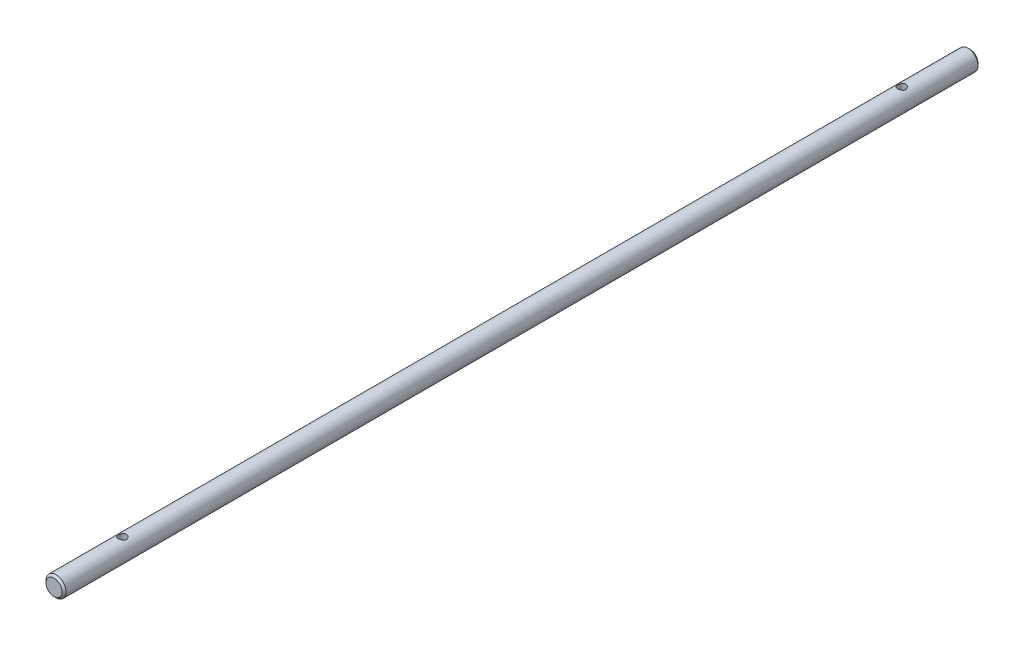
ISO-10303-21;
HEADER;
FILE_DESCRIPTION(('STEP AP214'),'2;1');
FILE_NAME('part.step','',(''),(''),'','','');
FILE_SCHEMA(('AUTOMOTIVE_DESIGN { 1 0 10303 214 1 1 1 1 }'));
ENDSEC;
DATA;
#1=APPLICATION_CONTEXT('core data for automotive mechanical design processes');
#2=APPLICATION_PROTOCOL_DEFINITION('international standard','automotive_design',2000,#1);
#3=PRODUCT_CONTEXT('',#1,'mechanical');
#4=PRODUCT('Part','Part','',(#3));
#5=PRODUCT_RELATED_PRODUCT_CATEGORY('part','',(#4));
#6=PRODUCT_DEFINITION_FORMATION('','',#4);
#7=PRODUCT_DEFINITION_CONTEXT('part definition',#1,'design');
#8=PRODUCT_DEFINITION('design','',#6,#7);
#9=PRODUCT_DEFINITION_SHAPE('','',#8);
#10=(LENGTH_UNIT() NAMED_UNIT(*) SI_UNIT(.MILLI.,.METRE.));
#11=(NAMED_UNIT(*) PLANE_ANGLE_UNIT() SI_UNIT($,.RADIAN.));
#12=(NAMED_UNIT(*) SI_UNIT($,.STERADIAN.) SOLID_ANGLE_UNIT());
#13=UNCERTAINTY_MEASURE_WITH_UNIT(LENGTH_MEASURE(1.E-05),#10,'distance_accuracy_value','');
#14=(GEOMETRIC_REPRESENTATION_CONTEXT(3) GLOBAL_UNCERTAINTY_ASSIGNED_CONTEXT((#13)) GLOBAL_UNIT_ASSIGNED_CONTEXT((#10,
#11,#12)) REPRESENTATION_CONTEXT('',''));
#15=CARTESIAN_POINT('',(0.,0.,0.));
#16=DIRECTION('',(0.,0.,1.));
#17=DIRECTION('',(1.,0.,0.));
#18=AXIS2_PLACEMENT_3D('',#15,#16,#17);
#19=CARTESIAN_POINT('',(0.,0.,228.));
#20=DIRECTION('',(0.,0.,-1.));
#21=DIRECTION('',(-1.,0.,0.));
#22=AXIS2_PLACEMENT_3D('',#19,#20,#21);
#23=CYLINDRICAL_SURFACE('',#22,2.5);
#24=CARTESIAN_POINT('',(0.,-2.49999999999999,212.));
#25=CARTESIAN_POINT('',(0.0537465027214453,-2.4999963561354,211.999995074088));
#26=CARTESIAN_POINT('',(0.107586282045337,-2.49824647153466,211.995641123956));
#27=CARTESIAN_POINT('',(0.213748240208949,-2.49141726550321,211.978376148239));
#28=CARTESIAN_POINT('',(0.266065888780626,-2.48632889349439,211.965441860457));
#29=CARTESIAN_POINT('',(0.367476961363706,-2.47337104606559,211.931561960971));
#30=CARTESIAN_POINT('',(0.416580330808486,-2.46551068182036,211.910642576892));
#31=CARTESIAN_POINT('',(0.51053598516419,-2.44778305398039,211.861490413337));
#32=CARTESIAN_POINT('',(0.5553897383755,-2.43791648729028,211.833260172541));
#33=CARTESIAN_POINT('',(0.641750503785199,-2.41665443085209,211.76888225072));
#34=CARTESIAN_POINT('',(0.68303113627511,-2.40521148464595,211.73244667188));
#35=CARTESIAN_POINT('',(0.759087502392361,-2.38230288453097,211.653299998262));
#36=CARTESIAN_POINT('',(0.79386005356676,-2.37083722226896,211.610585851394));
#37=CARTESIAN_POINT('',(0.857437283646434,-2.34861395898568,211.517785964879));
#38=CARTESIAN_POINT('',(0.885907490597738,-2.33791057982476,211.467456756988));
#39=CARTESIAN_POINT('',(0.933877359518579,-2.31916823593396,211.36223180079));
#40=CARTESIAN_POINT('',(0.953381282142921,-2.31112800622088,211.307338236076));
#41=CARTESIAN_POINT('',(0.981949411697937,-2.29913178830409,211.197143833204));
#42=CARTESIAN_POINT('',(0.991446982902829,-2.29500710177802,211.141974382212));
#43=CARTESIAN_POINT('',(1.00108648082002,-2.29082002024572,211.030682500846));
#44=CARTESIAN_POINT('',(1.00123300815661,-2.29075562761384,210.974560552688));
#45=CARTESIAN_POINT('',(0.992494683752272,-2.29455250139997,210.867121664271));
#46=CARTESIAN_POINT('',(0.984237657152572,-2.29814087519225,210.815742142796));
#47=CARTESIAN_POINT('',(0.959973440148913,-2.30838093803918,210.715170221997));
#48=CARTESIAN_POINT('',(0.943964897402315,-2.31503316160836,210.665978205945));
#49=CARTESIAN_POINT('',(0.904347366275531,-2.33079742544265,210.569991081902));
#50=CARTESIAN_POINT('',(0.880589931157651,-2.33995689640394,210.523265380473));
#51=CARTESIAN_POINT('',(0.826253230366097,-2.35969058194945,210.434292091819));
#52=CARTESIAN_POINT('',(0.795671402550412,-2.37026532728425,210.392046195299));
#53=CARTESIAN_POINT('',(0.725775299727214,-2.39263368371135,210.309795135599));
#54=CARTESIAN_POINT('',(0.685968731485321,-2.40445832488076,210.270215635277));
#55=CARTESIAN_POINT('',(0.600157213715104,-2.42729912479141,210.198157760999));
#56=CARTESIAN_POINT('',(0.554151032667222,-2.43831512222662,210.165680801295));
#57=CARTESIAN_POINT('',(0.456038826302923,-2.45857340632274,210.108191276292));
#58=CARTESIAN_POINT('',(0.403830245673238,-2.46777635047707,210.083338859401));
#59=CARTESIAN_POINT('',(0.295511882741437,-2.4830741416438,210.042916069461));
#60=CARTESIAN_POINT('',(0.239404098424832,-2.48917056731191,210.027340981221));
#61=CARTESIAN_POINT('',(0.128447943803903,-2.49728069753455,210.00677585229));
#62=CARTESIAN_POINT('',(0.0737216469927591,-2.49951472916757,210.001213772873));
#63=CARTESIAN_POINT('',(-0.0359226549039192,-2.50034239255315,209.999143449736));
#64=CARTESIAN_POINT('',(-0.0908406066119739,-2.49893696791146,210.002632859226));
#65=CARTESIAN_POINT('',(-0.196716369561005,-2.49278783531876,210.018145876276));
#66=CARTESIAN_POINT('',(-0.247741245887747,-2.48819695672762,210.029778990176));
#67=CARTESIAN_POINT('',(-0.347067714030399,-2.4762972070275,210.060717854155));
#68=CARTESIAN_POINT('',(-0.395368955112432,-2.46898798678265,210.080024589834));
#69=CARTESIAN_POINT('',(-0.48953939290836,-2.45208297385406,210.12639246984));
#70=CARTESIAN_POINT('',(-0.535289011377711,-2.44242407989902,210.153672736022));
#71=CARTESIAN_POINT('',(-0.621721795623284,-2.42186682372762,210.214970161953));
#72=CARTESIAN_POINT('',(-0.662402920380567,-2.41096796555135,210.248990021461));
#73=CARTESIAN_POINT('',(-0.74036152151441,-2.38822558819056,210.325435006475));
#74=CARTESIAN_POINT('',(-0.777236966903033,-2.37636720712526,210.368266770753));
#75=CARTESIAN_POINT('',(-0.843375598706858,-2.35370836458566,210.459720041505));
#76=CARTESIAN_POINT('',(-0.872637530668759,-2.34290807763255,210.50834250017));
#77=CARTESIAN_POINT('',(-0.922903750965823,-2.32357149953854,210.610730847297));
#78=CARTESIAN_POINT('',(-0.943825297267238,-2.31505815442393,210.664541999606));
#79=CARTESIAN_POINT('',(-0.976148109852659,-2.30161836738965,210.775366825858));
#80=CARTESIAN_POINT('',(-0.987556402634662,-2.29668927847999,210.832378102906));
#81=CARTESIAN_POINT('',(-0.999857808639203,-2.29135879649963,210.943563950887));
#82=CARTESIAN_POINT('',(-1.00144854115144,-2.29065710504086,210.997647419797));
#83=CARTESIAN_POINT('',(-0.995901579638762,-2.29307418016549,211.105272428857));
#84=CARTESIAN_POINT('',(-0.988764993956891,-2.29619246162397,211.158814036951));
#85=CARTESIAN_POINT('',(-0.966535683076824,-2.3056332453951,211.261666094928));
#86=CARTESIAN_POINT('',(-0.951768746785487,-2.31182415913725,211.311060137217));
#87=CARTESIAN_POINT('',(-0.915002724245496,-2.32662000616349,211.406689314807));
#88=CARTESIAN_POINT('',(-0.893001640696892,-2.33522560603004,211.45292357345));
#89=CARTESIAN_POINT('',(-0.840936381379846,-2.35449304802246,211.543804809635));
#90=CARTESIAN_POINT('',(-0.810482667579725,-2.36524441156622,211.588209335065));
#91=CARTESIAN_POINT('',(-0.742946059635728,-2.38731902186119,211.671496658602));
#92=CARTESIAN_POINT('',(-0.705861167409043,-2.39864244024204,211.710377786064));
#93=CARTESIAN_POINT('',(-0.623252753136219,-2.42146783543697,211.784101426632));
#94=CARTESIAN_POINT('',(-0.577338000573056,-2.43293378981093,211.818518653449));
#95=CARTESIAN_POINT('',(-0.479950160142878,-2.45400203356859,211.879168521311));
#96=CARTESIAN_POINT('',(-0.428474502273609,-2.46360345546453,211.905397356076));
#97=CARTESIAN_POINT('',(-0.322369031247594,-2.47969857407931,211.948311107595));
#98=CARTESIAN_POINT('',(-0.26781580910984,-2.48624681527514,211.96516466178));
#99=CARTESIAN_POINT('',(-0.156438273140599,-2.49572153104683,211.989319560477));
#100=CARTESIAN_POINT('',(-0.0996217629294417,-2.4986594974782,211.996651218372));
#101=CARTESIAN_POINT('',(-0.0284561489454537,-2.49987949752068,211.999697690489));
#102=CARTESIAN_POINT('',(-0.0142313443703737,-2.50000096484587,212.000001304315));
#103=CARTESIAN_POINT('',(0.,-2.49999999999999,212.));
#104=B_SPLINE_CURVE_WITH_KNOTS('',3,(#24,#25,#26,#27,#28,#29,#30,#31,#32,#33,#34,#35,#36,#37,
#38,#39,#40,#41,#42,#43,#44,#45,#46,#47,#48,#49,#50,#51,#52,#53,#54,#55,#56,#57,#58,#59,#60,#61,
#62,#63,#64,#65,#66,#67,#68,#69,#70,#71,#72,#73,#74,#75,#76,#77,#78,#79,#80,#81,#82,#83,#84,#85,
#86,#87,#88,#89,#90,#91,#92,#93,#94,#95,#96,#97,#98,#99,#100,#101,#102,#103),.UNSPECIFIED.,.T.,
.F.,(4,2,2,2,2,2,2,2,2,2,2,2,2,2,2,2,2,2,2,2,2,2,2,2,2,2,2,2,2,2,2,2,2,2,2,2,2,2,2,4),(0.,
0.161201493946535,0.32284181800397,0.4839557287358,0.645013767839926,0.81298690850198,
0.98104197467205,1.1565762940961,1.33202711559136,1.49952052654417,1.66693153170245,
1.82269164200687,1.97847893628024,2.13744563149409,2.29647210969093,2.46779174593278,
2.63914546419865,2.81388456581404,2.98853478056896,3.15284592264005,3.31711446785043,
3.47400227782184,3.630910244969,3.79261756699132,3.95438979749485,4.12684237312206,
4.29932334521874,4.47347522570418,4.64749836322969,4.80899836696376,4.97047786281523,
5.12557159274389,5.28070817902585,5.44472734028352,5.60879600674198,5.78350211766922,
5.95828931820269,6.12982150506661,6.30080626202174,6.34349022948399),.UNSPECIFIED.);
#105=CARTESIAN_POINT('',(0.,-2.49999999999999,212.));
#106=VERTEX_POINT('',#105);
#107=EDGE_CURVE('E33',#106,#106,#104,.T.);
#108=ORIENTED_EDGE('',*,*,#107,.T.);
#109=EDGE_LOOP('',(#108));
#110=FACE_BOUND('',#109,.T.);
#111=CARTESIAN_POINT('',(0.,2.50000000000001,212.));
#112=CARTESIAN_POINT('',(-0.053746502721444,2.49999635613545,211.999995074088));
#113=CARTESIAN_POINT('',(-0.107586282045334,2.49824647153467,211.995641123956));
#114=CARTESIAN_POINT('',(-0.213748240208946,2.4914172655032,211.978376148239));
#115=CARTESIAN_POINT('',(-0.266065888780624,2.48632889349438,211.965441860457));
#116=CARTESIAN_POINT('',(-0.367476961363706,2.47337104606559,211.931561960971));
#117=CARTESIAN_POINT('',(-0.416580330808487,2.46551068182036,211.910642576892));
#118=CARTESIAN_POINT('',(-0.510535985164191,2.44778305398039,211.861490413337));
#119=CARTESIAN_POINT('',(-0.5553897383755,2.43791648729028,211.833260172541));
#120=CARTESIAN_POINT('',(-0.641750503785198,2.41665443085209,211.76888225072));
#121=CARTESIAN_POINT('',(-0.68303113627511,2.40521148464595,211.73244667188));
#122=CARTESIAN_POINT('',(-0.75908750239236,2.38230288453097,211.653299998262));
#123=CARTESIAN_POINT('',(-0.79386005356676,2.37083722226896,211.610585851394));
#124=CARTESIAN_POINT('',(-0.857437283646434,2.34861395898568,211.517785964879));
#125=CARTESIAN_POINT('',(-0.885907490597738,2.33791057982476,211.467456756988));
#126=CARTESIAN_POINT('',(-0.933877359518579,2.31916823593396,211.36223180079));
#127=CARTESIAN_POINT('',(-0.953381282142921,2.31112800622088,211.307338236076));
#128=CARTESIAN_POINT('',(-0.981949411697935,2.29913178830409,211.197143833204));
#129=CARTESIAN_POINT('',(-0.991446982902826,2.29500710177802,211.141974382212));
#130=CARTESIAN_POINT('',(-1.00108648082002,2.29082002024572,211.030682500846));
#131=CARTESIAN_POINT('',(-1.00123300815661,2.29075562761384,210.974560552688));
#132=CARTESIAN_POINT('',(-0.992494683752273,2.29455250139997,210.867121664271));
#133=CARTESIAN_POINT('',(-0.984237657152572,2.29814087519225,210.815742142796));
#134=CARTESIAN_POINT('',(-0.959973440148912,2.30838093803918,210.715170221997));
#135=CARTESIAN_POINT('',(-0.943964897402314,2.31503316160837,210.665978205945));
#136=CARTESIAN_POINT('',(-0.904347366275538,2.33079742544265,210.569991081902));
#137=CARTESIAN_POINT('',(-0.880589931157669,2.33995689640393,210.523265380473));
#138=CARTESIAN_POINT('',(-0.826253230366125,2.35969058194944,210.434292091819));
#139=CARTESIAN_POINT('',(-0.795671402550437,2.37026532728424,210.392046195299));
#140=CARTESIAN_POINT('',(-0.725775299727235,2.39263368371135,210.309795135599));
#141=CARTESIAN_POINT('',(-0.685968731485341,2.40445832488075,210.270215635277));
#142=CARTESIAN_POINT('',(-0.600157213715119,2.4272991247914,210.198157760999));
#143=CARTESIAN_POINT('',(-0.554151032667232,2.43831512222662,210.165680801295));
#144=CARTESIAN_POINT('',(-0.456038826302925,2.45857340632274,210.108191276292));
#145=CARTESIAN_POINT('',(-0.40383024567324,2.46777635047707,210.083338859401));
#146=CARTESIAN_POINT('',(-0.295511882741437,2.48307414164379,210.042916069461));
#147=CARTESIAN_POINT('',(-0.239404098424832,2.48917056731191,210.027340981221));
#148=CARTESIAN_POINT('',(-0.128447943803903,2.49728069753455,210.00677585229));
#149=CARTESIAN_POINT('',(-0.0737216469927593,2.49951472916757,210.001213772873));
#150=CARTESIAN_POINT('',(0.0359226549039191,2.50034239255315,209.999143449736));
#151=CARTESIAN_POINT('',(0.0908406066119736,2.49893696791146,210.002632859226));
#152=CARTESIAN_POINT('',(0.196716369561005,2.49278783531876,210.018145876276));
#153=CARTESIAN_POINT('',(0.247741245887747,2.48819695672762,210.029778990176));
#154=CARTESIAN_POINT('',(0.347067714030398,2.4762972070275,210.060717854155));
#155=CARTESIAN_POINT('',(0.395368955112431,2.46898798678265,210.080024589834));
#156=CARTESIAN_POINT('',(0.48953939290836,2.45208297385406,210.12639246984));
#157=CARTESIAN_POINT('',(0.535289011377711,2.44242407989902,210.153672736022));
#158=CARTESIAN_POINT('',(0.621721795623284,2.42186682372762,210.214970161953));
#159=CARTESIAN_POINT('',(0.662402920380566,2.41096796555135,210.248990021461));
#160=CARTESIAN_POINT('',(0.74036152151441,2.38822558819056,210.325435006475));
#161=CARTESIAN_POINT('',(0.777236966903033,2.37636720712526,210.368266770753));
#162=CARTESIAN_POINT('',(0.843375598706858,2.35370836458566,210.459720041505));
#163=CARTESIAN_POINT('',(0.872637530668759,2.34290807763255,210.50834250017));
#164=CARTESIAN_POINT('',(0.922903750965823,2.32357149953854,210.610730847297));
#165=CARTESIAN_POINT('',(0.943825297267238,2.31505815442393,210.664541999606));
#166=CARTESIAN_POINT('',(0.976148109852659,2.30161836738965,210.775366825858));
#167=CARTESIAN_POINT('',(0.987556402634662,2.29668927847999,210.832378102906));
#168=CARTESIAN_POINT('',(0.999857808639203,2.29135879649963,210.943563950887));
#169=CARTESIAN_POINT('',(1.00144854115144,2.29065710504086,210.997647419797));
#170=CARTESIAN_POINT('',(0.995901579638762,2.29307418016549,211.105272428857));
#171=CARTESIAN_POINT('',(0.988764993956891,2.29619246162397,211.158814036951));
#172=CARTESIAN_POINT('',(0.966535683076824,2.3056332453951,211.261666094928));
#173=CARTESIAN_POINT('',(0.951768746785486,2.31182415913725,211.311060137217));
#174=CARTESIAN_POINT('',(0.915002724245496,2.32662000616349,211.406689314807));
#175=CARTESIAN_POINT('',(0.893001640696893,2.33522560603004,211.45292357345));
#176=CARTESIAN_POINT('',(0.84093638137985,2.35449304802246,211.543804809635));
#177=CARTESIAN_POINT('',(0.810482667579731,2.36524441156621,211.588209335065));
#178=CARTESIAN_POINT('',(0.742946059635736,2.38731902186119,211.671496658602));
#179=CARTESIAN_POINT('',(0.705861167409049,2.39864244024203,211.710377786064));
#180=CARTESIAN_POINT('',(0.62325275313622,2.42146783543697,211.784101426632));
#181=CARTESIAN_POINT('',(0.577338000573056,2.43293378981093,211.818518653449));
#182=CARTESIAN_POINT('',(0.479950160142876,2.45400203356859,211.879168521311));
#183=CARTESIAN_POINT('',(0.428474502273608,2.46360345546453,211.905397356076));
#184=CARTESIAN_POINT('',(0.322369031247594,2.47969857407931,211.948311107595));
#185=CARTESIAN_POINT('',(0.267815809109841,2.48624681527514,211.96516466178));
#186=CARTESIAN_POINT('',(0.1564382731406,2.49572153104682,211.989319560477));
#187=CARTESIAN_POINT('',(0.0996217629294421,2.49865949747817,211.996651218372));
#188=CARTESIAN_POINT('',(0.0284561489454537,2.49987949752069,211.999697690489));
#189=CARTESIAN_POINT('',(0.0142313443703736,2.50000096484589,212.000001304315));
#190=CARTESIAN_POINT('',(0.,2.50000000000001,212.));
#191=B_SPLINE_CURVE_WITH_KNOTS('',3,(#111,#112,#113,#114,#115,#116,#117,#118,#119,#120,#121,
#122,#123,#124,#125,#126,#127,#128,#129,#130,#131,#132,#133,#134,#135,#136,#137,#138,#139,#140,
#141,#142,#143,#144,#145,#146,#147,#148,#149,#150,#151,#152,#153,#154,#155,#156,#157,#158,#159,
#160,#161,#162,#163,#164,#165,#166,#167,#168,#169,#170,#171,#172,#173,#174,#175,#176,#177,#178,
#179,#180,#181,#182,#183,#184,#185,#186,#187,#188,#189,#190),.UNSPECIFIED.,.T.,.F.,(4,2,2,2,2,2,
2,2,2,2,2,2,2,2,2,2,2,2,2,2,2,2,2,2,2,2,2,2,2,2,2,2,2,2,2,2,2,2,2,4),(0.,0.161201493946532,
0.32284181800397,0.483955728735801,0.645013767839926,0.812986908501981,0.98104197467205,
1.1565762940961,1.33202711559136,1.49952052654414,1.66693153170245,1.82269164200687,
1.97847893628024,2.13744563149405,2.29647210969089,2.46779174593274,2.63914546419865,
2.81388456581404,2.98853478056896,3.15284592264005,3.31711446785043,3.47400227782185,
3.630910244969,3.79261756699132,3.95438979749485,4.12684237312206,4.29932334521875,
4.47347522570418,4.6474983632297,4.80899836696376,4.97047786281524,5.12557159274389,
5.28070817902585,5.4447273402835,5.60879600674198,5.78350211766922,5.95828931820269,
6.12982150506661,6.30080626202174,6.34349022948399),.UNSPECIFIED.);
#192=CARTESIAN_POINT('',(0.,2.50000000000001,212.));
#193=VERTEX_POINT('',#192);
#194=EDGE_CURVE('E91',#193,#193,#191,.T.);
#195=ORIENTED_EDGE('',*,*,#194,.T.);
#196=EDGE_LOOP('',(#195));
#197=FACE_BOUND('',#196,.T.);
#198=CARTESIAN_POINT('',(0.,-2.49999999999999,18.));
#199=CARTESIAN_POINT('',(0.0537465027214464,-2.4999963561354,17.9999950740881));
#200=CARTESIAN_POINT('',(0.107586282045338,-2.49824647153466,17.9956411239558));
#201=CARTESIAN_POINT('',(0.213748240208949,-2.49141726550322,17.9783761482394));
#202=CARTESIAN_POINT('',(0.266065888780624,-2.48632889349439,17.9654418604569));
#203=CARTESIAN_POINT('',(0.3674769613637,-2.47337104606559,17.9315619609706));
#204=CARTESIAN_POINT('',(0.416580330808477,-2.46551068182036,17.9106425768916));
#205=CARTESIAN_POINT('',(0.510535985164182,-2.44778305398039,17.8614904133367));
#206=CARTESIAN_POINT('',(0.555389738375494,-2.43791648729028,17.8332601725405));
#207=CARTESIAN_POINT('',(0.641750503785196,-2.41665443085209,17.7688822507195));
#208=CARTESIAN_POINT('',(0.683031136275106,-2.40521148464595,17.7324466718799));
#209=CARTESIAN_POINT('',(0.759087502392361,-2.38230288453097,17.6532999982616));
#210=CARTESIAN_POINT('',(0.793860053566766,-2.37083722226896,17.6105858513941));
#211=CARTESIAN_POINT('',(0.85743728364644,-2.34861395898568,17.5177859648789));
#212=CARTESIAN_POINT('',(0.885907490597737,-2.33791057982476,17.4674567569884));
#213=CARTESIAN_POINT('',(0.933877359518575,-2.31916823593396,17.36223180079));
#214=CARTESIAN_POINT('',(0.953381282142919,-2.31112800622088,17.3073382360758));
#215=CARTESIAN_POINT('',(0.981949411697936,-2.29913178830409,17.1971438332039));
#216=CARTESIAN_POINT('',(0.991446982902826,-2.29500710177802,17.1419743822119));
#217=CARTESIAN_POINT('',(1.00108648082002,-2.29082002024572,17.0306825008464));
#218=CARTESIAN_POINT('',(1.00123300815661,-2.29075562761384,16.9745605526875));
#219=CARTESIAN_POINT('',(0.992494683752274,-2.29455250139997,16.867121664271));
#220=CARTESIAN_POINT('',(0.98423765715257,-2.29814087519225,16.8157421427955));
#221=CARTESIAN_POINT('',(0.959973440148911,-2.30838093803918,16.7151702219966));
#222=CARTESIAN_POINT('',(0.943964897402316,-2.31503316160836,16.6659782059448));
#223=CARTESIAN_POINT('',(0.904347366275537,-2.33079742544265,16.569991081902));
#224=CARTESIAN_POINT('',(0.880589931157658,-2.33995689640394,16.5232653804727));
#225=CARTESIAN_POINT('',(0.826253230366106,-2.35969058194945,16.4342920918192));
#226=CARTESIAN_POINT('',(0.79567140255042,-2.37026532728424,16.3920461952986));
#227=CARTESIAN_POINT('',(0.725775299727216,-2.39263368371135,16.309795135599));
#228=CARTESIAN_POINT('',(0.685968731485317,-2.40445832488076,16.270215635277));
#229=CARTESIAN_POINT('',(0.600157213715097,-2.42729912479141,16.198157760999));
#230=CARTESIAN_POINT('',(0.554151032667218,-2.43831512222662,16.1656808012949));
#231=CARTESIAN_POINT('',(0.456038826302924,-2.45857340632274,16.1081912762921));
#232=CARTESIAN_POINT('',(0.403830245673242,-2.46777635047707,16.0833388594015));
#233=CARTESIAN_POINT('',(0.295511882741445,-2.48307414164379,16.042916069461));
#234=CARTESIAN_POINT('',(0.239404098424841,-2.48917056731191,16.0273409812213));
#235=CARTESIAN_POINT('',(0.128447943803914,-2.49728069753455,16.0067758522902));
#236=CARTESIAN_POINT('',(0.0737216469927709,-2.49951472916757,16.0012137728732));
#237=CARTESIAN_POINT('',(-0.0359226549039057,-2.50034239255315,15.9991434497357));
#238=CARTESIAN_POINT('',(-0.0908406066119594,-2.49893696791146,16.0026328592262));
#239=CARTESIAN_POINT('',(-0.196716369560992,-2.49278783531876,16.018145876276));
#240=CARTESIAN_POINT('',(-0.247741245887736,-2.48819695672762,16.0297789901755));
#241=CARTESIAN_POINT('',(-0.34706771403039,-2.4762972070275,16.0607178541549));
#242=CARTESIAN_POINT('',(-0.395368955112423,-2.46898798678265,16.0800245898343));
#243=CARTESIAN_POINT('',(-0.489539392908352,-2.45208297385406,16.12639246984));
#244=CARTESIAN_POINT('',(-0.535289011377704,-2.44242407989902,16.1536727360216));
#245=CARTESIAN_POINT('',(-0.62172179562328,-2.42186682372762,16.2149701619528));
#246=CARTESIAN_POINT('',(-0.662402920380565,-2.41096796555135,16.2489900214613));
#247=CARTESIAN_POINT('',(-0.740361521514412,-2.38822558819056,16.3254350064748));
#248=CARTESIAN_POINT('',(-0.777236966903036,-2.37636720712526,16.3682667707531));
#249=CARTESIAN_POINT('',(-0.843375598706858,-2.35370836458566,16.4597200415047));
#250=CARTESIAN_POINT('',(-0.872637530668756,-2.34290807763255,16.50834250017));
#251=CARTESIAN_POINT('',(-0.922903750965815,-2.32357149953854,16.6107308472971));
#252=CARTESIAN_POINT('',(-0.943825297267228,-2.31505815442394,16.6645419996062));
#253=CARTESIAN_POINT('',(-0.976148109852653,-2.30161836738966,16.7753668258576));
#254=CARTESIAN_POINT('',(-0.987556402634659,-2.29668927847999,16.8323781029062));
#255=CARTESIAN_POINT('',(-0.999857808639203,-2.29135879649963,16.9435639508873));
#256=CARTESIAN_POINT('',(-1.00144854115144,-2.29065710504086,16.9976474197967));
#257=CARTESIAN_POINT('',(-0.995901579638764,-2.29307418016549,17.1052724288566));
#258=CARTESIAN_POINT('',(-0.988764993956893,-2.29619246162397,17.1588140369513));
#259=CARTESIAN_POINT('',(-0.966535683076827,-2.3056332453951,17.2616660949275));
#260=CARTESIAN_POINT('',(-0.951768746785492,-2.31182415913725,17.3110601372165));
#261=CARTESIAN_POINT('',(-0.91500272424551,-2.32662000616348,17.4066893148067));
#262=CARTESIAN_POINT('',(-0.89300164069691,-2.33522560603003,17.4529235734499));
#263=CARTESIAN_POINT('',(-0.840936381379868,-2.35449304802246,17.5438048096354));
#264=CARTESIAN_POINT('',(-0.810482667579748,-2.36524441156621,17.5882093350652));
#265=CARTESIAN_POINT('',(-0.742946059635751,-2.38731902186119,17.6714966586019));
#266=CARTESIAN_POINT('',(-0.705861167409064,-2.39864244024203,17.7103777860642));
#267=CARTESIAN_POINT('',(-0.623252753136233,-2.42146783543697,17.7841014266318));
#268=CARTESIAN_POINT('',(-0.57733800057307,-2.43293378981093,17.818518653449));
#269=CARTESIAN_POINT('',(-0.479950160142889,-2.45400203356858,17.8791685213108));
#270=CARTESIAN_POINT('',(-0.428474502273618,-2.46360345546453,17.9053973560763));
#271=CARTESIAN_POINT('',(-0.3223690312476,-2.4796985740793,17.9483111075951));
#272=CARTESIAN_POINT('',(-0.267815809109845,-2.48624681527513,17.9651646617802));
#273=CARTESIAN_POINT('',(-0.156438273140607,-2.49572153104683,17.9893195604771));
#274=CARTESIAN_POINT('',(-0.0996217629294543,-2.4986594974782,17.996651218372));
#275=CARTESIAN_POINT('',(-0.0284561489454639,-2.49987949752068,17.9996976904891));
#276=CARTESIAN_POINT('',(-0.0142313443703787,-2.50000096484587,18.0000013043146));
#277=CARTESIAN_POINT('',(0.,-2.49999999999999,18.));
#278=B_SPLINE_CURVE_WITH_KNOTS('',3,(#198,#199,#200,#201,#202,#203,#204,#205,#206,#207,#208,
#209,#210,#211,#212,#213,#214,#215,#216,#217,#218,#219,#220,#221,#222,#223,#224,#225,#226,#227,
#228,#229,#230,#231,#232,#233,#234,#235,#236,#237,#238,#239,#240,#241,#242,#243,#244,#245,#246,
#247,#248,#249,#250,#251,#252,#253,#254,#255,#256,#257,#258,#259,#260,#261,#262,#263,#264,#265,
#266,#267,#268,#269,#270,#271,#272,#273,#274,#275,#276,#277),.UNSPECIFIED.,.T.,.F.,(4,2,2,2,2,2,
2,2,2,2,2,2,2,2,2,2,2,2,2,2,2,2,2,2,2,2,2,2,2,2,2,2,2,2,2,2,2,2,2,4),(0.,0.161201493946537,
0.322841818003966,0.483955728735787,0.645013767839919,0.812986908501986,0.981041974672056,
1.15657629409608,1.33202711559134,1.49952052654415,1.66693153170244,1.82269164200687,
1.97847893628024,2.13744563149409,2.29647210969092,2.46779174593279,2.63914546419867,
2.81388456581403,2.98853478056895,3.15284592264004,3.31711446785041,3.47400227782183,
3.63091024496899,3.79261756699132,3.95438979749485,4.12684237312208,4.29932334521875,
4.47347522570414,4.64749836322967,4.80899836696375,4.97047786281523,5.12557159274385,
5.28070817902581,5.44472734028347,5.60879600674197,5.78350211766919,5.95828931820268,
6.12982150506661,6.30080626202172,6.34349022948399),.UNSPECIFIED.);
#279=CARTESIAN_POINT('',(0.,-2.49999999999999,18.));
#280=VERTEX_POINT('',#279);
#281=EDGE_CURVE('E55',#280,#280,#278,.T.);
#282=ORIENTED_EDGE('',*,*,#281,.T.);
#283=EDGE_LOOP('',(#282));
#284=FACE_BOUND('',#283,.T.);
#285=CARTESIAN_POINT('',(0.,2.50000000000001,18.));
#286=CARTESIAN_POINT('',(-0.0537465027214451,2.49999635613545,17.9999950740881));
#287=CARTESIAN_POINT('',(-0.107586282045336,2.49824647153467,17.9956411239558));
#288=CARTESIAN_POINT('',(-0.213748240208946,2.4914172655032,17.9783761482394));
#289=CARTESIAN_POINT('',(-0.266065888780622,2.48632889349438,17.9654418604569));
#290=CARTESIAN_POINT('',(-0.3674769613637,2.4733710460656,17.9315619609706));
#291=CARTESIAN_POINT('',(-0.416580330808479,2.46551068182036,17.9106425768916));
#292=CARTESIAN_POINT('',(-0.510535985164183,2.44778305398039,17.8614904133367));
#293=CARTESIAN_POINT('',(-0.555389738375494,2.43791648729028,17.8332601725405));
#294=CARTESIAN_POINT('',(-0.641750503785194,2.41665443085209,17.7688822507195));
#295=CARTESIAN_POINT('',(-0.683031136275104,2.40521148464595,17.7324466718799));
#296=CARTESIAN_POINT('',(-0.759087502392359,2.38230288453097,17.6532999982616));
#297=CARTESIAN_POINT('',(-0.793860053566765,2.37083722226896,17.6105858513941));
#298=CARTESIAN_POINT('',(-0.857437283646438,2.34861395898568,17.5177859648789));
#299=CARTESIAN_POINT('',(-0.885907490597736,2.33791057982476,17.4674567569884));
#300=CARTESIAN_POINT('',(-0.933877359518574,2.31916823593396,17.36223180079));
#301=CARTESIAN_POINT('',(-0.953381282142918,2.31112800622088,17.3073382360758));
#302=CARTESIAN_POINT('',(-0.981949411697935,2.29913178830409,17.197143833204));
#303=CARTESIAN_POINT('',(-0.991446982902825,2.29500710177802,17.1419743822119));
#304=CARTESIAN_POINT('',(-1.00108648082002,2.29082002024572,17.0306825008464));
#305=CARTESIAN_POINT('',(-1.00123300815661,2.29075562761384,16.9745605526875));
#306=CARTESIAN_POINT('',(-0.992494683752274,2.29455250139997,16.867121664271));
#307=CARTESIAN_POINT('',(-0.98423765715257,2.29814087519225,16.8157421427955));
#308=CARTESIAN_POINT('',(-0.959973440148912,2.30838093803918,16.7151702219966));
#309=CARTESIAN_POINT('',(-0.943964897402318,2.31503316160836,16.6659782059448));
#310=CARTESIAN_POINT('',(-0.904347366275539,2.33079742544265,16.569991081902));
#311=CARTESIAN_POINT('',(-0.88058993115766,2.33995689640394,16.5232653804727));
#312=CARTESIAN_POINT('',(-0.826253230366108,2.35969058194945,16.4342920918192));
#313=CARTESIAN_POINT('',(-0.795671402550423,2.37026532728424,16.3920461952986));
#314=CARTESIAN_POINT('',(-0.725775299727219,2.39263368371135,16.309795135599));
#315=CARTESIAN_POINT('',(-0.68596873148532,2.40445832488076,16.270215635277));
#316=CARTESIAN_POINT('',(-0.6001572137151,2.42729912479141,16.198157760999));
#317=CARTESIAN_POINT('',(-0.554151032667221,2.43831512222662,16.1656808012949));
#318=CARTESIAN_POINT('',(-0.456038826302927,2.45857340632274,16.1081912762921));
#319=CARTESIAN_POINT('',(-0.403830245673244,2.46777635047707,16.0833388594015));
#320=CARTESIAN_POINT('',(-0.295511882741447,2.48307414164379,16.042916069461));
#321=CARTESIAN_POINT('',(-0.239404098424843,2.48917056731191,16.0273409812213));
#322=CARTESIAN_POINT('',(-0.128447943803915,2.49728069753455,16.0067758522902));
#323=CARTESIAN_POINT('',(-0.0737216469927724,2.49951472916757,16.0012137728732));
#324=CARTESIAN_POINT('',(0.0359226549039041,2.50034239255315,15.9991434497357));
#325=CARTESIAN_POINT('',(0.0908406066119577,2.49893696791146,16.0026328592262));
#326=CARTESIAN_POINT('',(0.196716369560991,2.49278783531877,16.018145876276));
#327=CARTESIAN_POINT('',(0.247741245887735,2.48819695672762,16.0297789901755));
#328=CARTESIAN_POINT('',(0.347067714030388,2.4762972070275,16.0607178541549));
#329=CARTESIAN_POINT('',(0.39536895511242,2.46898798678265,16.0800245898343));
#330=CARTESIAN_POINT('',(0.48953939290835,2.45208297385406,16.12639246984));
#331=CARTESIAN_POINT('',(0.535289011377703,2.44242407989902,16.1536727360216));
#332=CARTESIAN_POINT('',(0.621721795623278,2.42186682372762,16.2149701619528));
#333=CARTESIAN_POINT('',(0.662402920380563,2.41096796555135,16.2489900214613));
#334=CARTESIAN_POINT('',(0.74036152151441,2.38822558819056,16.3254350064748));
#335=CARTESIAN_POINT('',(0.777236966903034,2.37636720712526,16.3682667707531));
#336=CARTESIAN_POINT('',(0.843375598706857,2.35370836458566,16.4597200415047));
#337=CARTESIAN_POINT('',(0.872637530668756,2.34290807763255,16.50834250017));
#338=CARTESIAN_POINT('',(0.922903750965815,2.32357149953854,16.6107308472971));
#339=CARTESIAN_POINT('',(0.943825297267228,2.31505815442394,16.6645419996062));
#340=CARTESIAN_POINT('',(0.976148109852653,2.30161836738966,16.7753668258576));
#341=CARTESIAN_POINT('',(0.987556402634659,2.29668927847999,16.8323781029062));
#342=CARTESIAN_POINT('',(0.999857808639202,2.29135879649963,16.9435639508873));
#343=CARTESIAN_POINT('',(1.00144854115144,2.29065710504086,16.9976474197967));
#344=CARTESIAN_POINT('',(0.995901579638764,2.29307418016549,17.1052724288566));
#345=CARTESIAN_POINT('',(0.988764993956894,2.29619246162397,17.1588140369513));
#346=CARTESIAN_POINT('',(0.966535683076828,2.3056332453951,17.2616660949275));
#347=CARTESIAN_POINT('',(0.951768746785493,2.31182415913724,17.3110601372165));
#348=CARTESIAN_POINT('',(0.915002724245511,2.32662000616348,17.4066893148067));
#349=CARTESIAN_POINT('',(0.893001640696912,2.33522560603003,17.4529235734499));
#350=CARTESIAN_POINT('',(0.84093638137987,2.35449304802246,17.5438048096354));
#351=CARTESIAN_POINT('',(0.810482667579749,2.36524441156621,17.5882093350652));
#352=CARTESIAN_POINT('',(0.742946059635753,2.38731902186118,17.6714966586019));
#353=CARTESIAN_POINT('',(0.705861167409067,2.39864244024203,17.7103777860642));
#354=CARTESIAN_POINT('',(0.623252753136238,2.42146783543697,17.7841014266318));
#355=CARTESIAN_POINT('',(0.577338000573074,2.43293378981093,17.818518653449));
#356=CARTESIAN_POINT('',(0.479950160142892,2.45400203356858,17.8791685213108));
#357=CARTESIAN_POINT('',(0.42847450227362,2.46360345546453,17.9053973560763));
#358=CARTESIAN_POINT('',(0.322369031247602,2.47969857407931,17.9483111075951));
#359=CARTESIAN_POINT('',(0.26781580910985,2.48624681527514,17.9651646617802));
#360=CARTESIAN_POINT('',(0.156438273140613,2.49572153104682,17.9893195604771));
#361=CARTESIAN_POINT('',(0.0996217629294591,2.49865949747817,17.996651218372));
#362=CARTESIAN_POINT('',(0.0284561489454668,2.49987949752069,17.9996976904891));
#363=CARTESIAN_POINT('',(0.0142313443703802,2.50000096484589,18.0000013043146));
#364=CARTESIAN_POINT('',(0.,2.50000000000001,18.));
#365=B_SPLINE_CURVE_WITH_KNOTS('',3,(#285,#286,#287,#288,#289,#290,#291,#292,#293,#294,#295,
#296,#297,#298,#299,#300,#301,#302,#303,#304,#305,#306,#307,#308,#309,#310,#311,#312,#313,#314,
#315,#316,#317,#318,#319,#320,#321,#322,#323,#324,#325,#326,#327,#328,#329,#330,#331,#332,#333,
#334,#335,#336,#337,#338,#339,#340,#341,#342,#343,#344,#345,#346,#347,#348,#349,#350,#351,#352,
#353,#354,#355,#356,#357,#358,#359,#360,#361,#362,#363,#364),.UNSPECIFIED.,.T.,.F.,(4,2,2,2,2,2,
2,2,2,2,2,2,2,2,2,2,2,2,2,2,2,2,2,2,2,2,2,2,2,2,2,2,2,2,2,2,2,2,2,4),(0.,0.161201493946534,
0.322841818003966,0.48395572873579,0.645013767839919,0.812986908501983,0.981041974672053,
1.15657629409608,1.33202711559134,1.49952052654414,1.66693153170244,1.82269164200686,
1.97847893628024,2.13744563149408,2.29647210969092,2.46779174593279,2.63914546419866,
2.81388456581403,2.98853478056895,3.15284592264004,3.31711446785041,3.47400227782183,
3.63091024496899,3.79261756699132,3.95438979749485,4.12684237312208,4.29932334521875,
4.47347522570415,4.64749836322967,4.80899836696374,4.97047786281523,5.12557159274385,
5.28070817902581,5.44472734028347,5.60879600674197,5.78350211766919,5.95828931820268,
6.1298215050666,6.30080626202172,6.34349022948399),.UNSPECIFIED.);
#366=CARTESIAN_POINT('',(0.,2.50000000000001,18.));
#367=VERTEX_POINT('',#366);
#368=EDGE_CURVE('E49',#367,#367,#365,.T.);
#369=ORIENTED_EDGE('',*,*,#368,.T.);
#370=EDGE_LOOP('',(#369));
#371=FACE_BOUND('',#370,.T.);
#372=CARTESIAN_POINT('',(0.,0.,0.5));
#373=DIRECTION('',(0.,0.,1.));
#374=DIRECTION('',(1.,0.,0.));
#375=AXIS2_PLACEMENT_3D('',#372,#373,#374);
#376=CIRCLE('',#375,2.5);
#377=CARTESIAN_POINT('',(2.5,0.,0.5));
#378=VERTEX_POINT('',#377);
#379=EDGE_CURVE('E45',#378,#378,#376,.T.);
#380=ORIENTED_EDGE('',*,*,#379,.T.);
#381=EDGE_LOOP('',(#380));
#382=FACE_BOUND('',#381,.T.);
#383=CARTESIAN_POINT('',(0.,0.,227.5));
#384=DIRECTION('',(0.,0.,1.));
#385=DIRECTION('',(1.,0.,0.));
#386=AXIS2_PLACEMENT_3D('',#383,#384,#385);
#387=CIRCLE('',#386,2.5);
#388=CARTESIAN_POINT('',(2.5,0.,227.5));
#389=VERTEX_POINT('',#388);
#390=EDGE_CURVE('E102',#389,#389,#387,.F.);
#391=ORIENTED_EDGE('',*,*,#390,.T.);
#392=EDGE_LOOP('',(#391));
#393=FACE_BOUND('',#392,.T.);
#394=ADVANCED_FACE('F29',(#110,#197,#284,#371,#382,#393),#23,.T.);
#395=CARTESIAN_POINT('',(0.,0.,228.));
#396=DIRECTION('',(0.,0.,1.));
#397=DIRECTION('',(1.,0.,0.));
#398=AXIS2_PLACEMENT_3D('',#395,#396,#397);
#399=PLANE('',#398);
#400=CARTESIAN_POINT('',(0.,0.,228.));
#401=DIRECTION('',(0.,0.,1.));
#402=DIRECTION('',(1.,0.,0.));
#403=AXIS2_PLACEMENT_3D('',#400,#401,#402);
#404=CIRCLE('',#403,1.99999999999999);
#405=CARTESIAN_POINT('',(1.99999999999999,0.,228.));
#406=VERTEX_POINT('',#405);
#407=EDGE_CURVE('E10',#406,#406,#404,.T.);
#408=ORIENTED_EDGE('',*,*,#407,.T.);
#409=EDGE_LOOP('',(#408));
#410=FACE_BOUND('',#409,.T.);
#411=ADVANCED_FACE('F76',(#410),#399,.T.);
#412=CARTESIAN_POINT('',(0.,0.,0.));
#413=DIRECTION('',(0.,0.,1.));
#414=DIRECTION('',(1.,0.,0.));
#415=AXIS2_PLACEMENT_3D('',#412,#413,#414);
#416=PLANE('',#415);
#417=CARTESIAN_POINT('',(0.,0.,0.));
#418=DIRECTION('',(0.,0.,1.));
#419=DIRECTION('',(1.,0.,0.));
#420=AXIS2_PLACEMENT_3D('',#417,#418,#419);
#421=CIRCLE('',#420,1.99999999999999);
#422=CARTESIAN_POINT('',(1.99999999999999,0.,0.));
#423=VERTEX_POINT('',#422);
#424=EDGE_CURVE('E40',#423,#423,#421,.F.);
#425=ORIENTED_EDGE('',*,*,#424,.T.);
#426=EDGE_LOOP('',(#425));
#427=FACE_BOUND('',#426,.T.);
#428=ADVANCED_FACE('F73',(#427),#416,.F.);
#429=CARTESIAN_POINT('',(0.,0.,0.5));
#430=DIRECTION('',(0.,0.,1.));
#431=DIRECTION('',(1.,0.,0.));
#432=AXIS2_PLACEMENT_3D('',#429,#430,#431);
#433=CONICAL_SURFACE('',#432,2.5,0.785398163397457);
#434=ORIENTED_EDGE('',*,*,#424,.F.);
#435=EDGE_LOOP('',(#434));
#436=FACE_BOUND('',#435,.T.);
#437=ORIENTED_EDGE('',*,*,#379,.F.);
#438=EDGE_LOOP('',(#437));
#439=FACE_BOUND('',#438,.T.);
#440=ADVANCED_FACE('F69',(#436,#439),#433,.T.);
#441=CARTESIAN_POINT('',(0.,0.,228.));
#442=DIRECTION('',(0.,0.,-1.));
#443=DIRECTION('',(-1.,0.,0.));
#444=AXIS2_PLACEMENT_3D('',#441,#442,#443);
#445=CONICAL_SURFACE('',#444,1.99999999999999,0.785398163397457);
#446=ORIENTED_EDGE('',*,*,#390,.F.);
#447=EDGE_LOOP('',(#446));
#448=FACE_BOUND('',#447,.T.);
#449=ORIENTED_EDGE('',*,*,#407,.F.);
#450=EDGE_LOOP('',(#449));
#451=FACE_BOUND('',#450,.T.);
#452=ADVANCED_FACE('F63',(#448,#451),#445,.T.);
#453=CARTESIAN_POINT('',(0.,-50.,17.));
#454=DIRECTION('',(0.,1.,0.));
#455=DIRECTION('',(0.,0.,1.));
#456=AXIS2_PLACEMENT_3D('',#453,#454,#455);
#457=CYLINDRICAL_SURFACE('',#456,1.);
#458=ORIENTED_EDGE('',*,*,#368,.F.);
#459=EDGE_LOOP('',(#458));
#460=FACE_BOUND('',#459,.T.);
#461=ORIENTED_EDGE('',*,*,#281,.F.);
#462=EDGE_LOOP('',(#461));
#463=FACE_BOUND('',#462,.T.);
#464=ADVANCED_FACE('F58',(#460,#463),#457,.F.);
#465=CARTESIAN_POINT('',(0.,-50.,211.));
#466=DIRECTION('',(0.,1.,0.));
#467=DIRECTION('',(0.,0.,1.));
#468=AXIS2_PLACEMENT_3D('',#465,#466,#467);
#469=CYLINDRICAL_SURFACE('',#468,1.);
#470=ORIENTED_EDGE('',*,*,#194,.F.);
#471=EDGE_LOOP('',(#470));
#472=FACE_BOUND('',#471,.T.);
#473=ORIENTED_EDGE('',*,*,#107,.F.);
#474=EDGE_LOOP('',(#473));
#475=FACE_BOUND('',#474,.T.);
#476=ADVANCED_FACE('F62',(#472,#475),#469,.F.);
#477=CLOSED_SHELL('',(#394,#411,#428,#440,#452,#464,#476));
#478=MANIFOLD_SOLID_BREP('B2',#477);
#479=ADVANCED_BREP_SHAPE_REPRESENTATION('',(#18,#478),#14);
#480=SHAPE_DEFINITION_REPRESENTATION(#9,#479);
ENDSEC;
END-ISO-10303-21;
